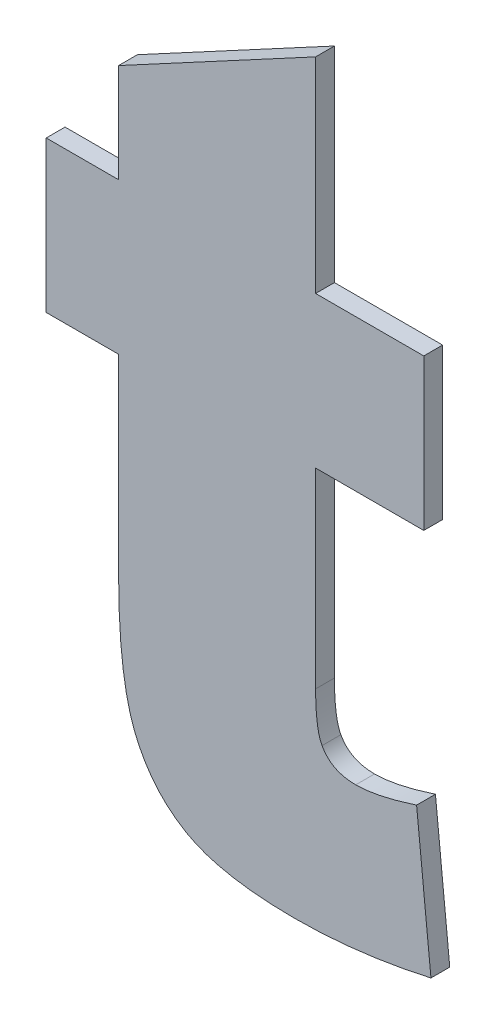
ISO-10303-21;
HEADER;
FILE_DESCRIPTION(('STEP AP214'),'2;1');
FILE_NAME('part.step','',(''),(''),'','','');
FILE_SCHEMA(('AUTOMOTIVE_DESIGN { 1 0 10303 214 1 1 1 1 }'));
ENDSEC;
DATA;
#1=APPLICATION_CONTEXT('core data for automotive mechanical design processes');
#2=APPLICATION_PROTOCOL_DEFINITION('international standard','automotive_design',2000,#1);
#3=PRODUCT_CONTEXT('',#1,'mechanical');
#4=PRODUCT('Part','Part','',(#3));
#5=PRODUCT_RELATED_PRODUCT_CATEGORY('part','',(#4));
#6=PRODUCT_DEFINITION_FORMATION('','',#4);
#7=PRODUCT_DEFINITION_CONTEXT('part definition',#1,'design');
#8=PRODUCT_DEFINITION('design','',#6,#7);
#9=PRODUCT_DEFINITION_SHAPE('','',#8);
#10=(LENGTH_UNIT() NAMED_UNIT(*) SI_UNIT(.MILLI.,.METRE.));
#11=(NAMED_UNIT(*) PLANE_ANGLE_UNIT() SI_UNIT($,.RADIAN.));
#12=(NAMED_UNIT(*) SI_UNIT($,.STERADIAN.) SOLID_ANGLE_UNIT());
#13=UNCERTAINTY_MEASURE_WITH_UNIT(LENGTH_MEASURE(1.E-05),#10,'distance_accuracy_value','');
#14=(GEOMETRIC_REPRESENTATION_CONTEXT(3) GLOBAL_UNCERTAINTY_ASSIGNED_CONTEXT((#13)) GLOBAL_UNIT_ASSIGNED_CONTEXT((#10,
#11,#12)) REPRESENTATION_CONTEXT('',''));
#15=CARTESIAN_POINT('',(0.,0.,0.));
#16=DIRECTION('',(0.,0.,1.));
#17=DIRECTION('',(1.,0.,0.));
#18=AXIS2_PLACEMENT_3D('',#15,#16,#17);
#19=CARTESIAN_POINT('',(1.2548751555268,-0.636643661734989,0.));
#20=DIRECTION('',(-1.,0.,0.));
#21=DIRECTION('',(0.,-1.,0.));
#22=AXIS2_PLACEMENT_3D('',#19,#20,#21);
#23=PLANE('',#22);
#24=DIRECTION('',(0.,-1.,0.));
#25=VECTOR('',#24,1.);
#26=CARTESIAN_POINT('',(1.2548751555268,-0.636643661734989,0.));
#27=LINE('',#26,#25);
#28=CARTESIAN_POINT('',(1.2548751555268,-0.636643661734989,0.));
#29=VERTEX_POINT('',#28);
#30=CARTESIAN_POINT('',(1.2548751555268,-0.660720812539698,0.));
#31=VERTEX_POINT('',#30);
#32=EDGE_CURVE('E11',#29,#31,#27,.T.);
#33=ORIENTED_EDGE('',*,*,#32,.T.);
#34=DIRECTION('',(0.,0.,1.));
#35=VECTOR('',#34,1.);
#36=CARTESIAN_POINT('',(1.2548751555268,-0.660720812539698,0.));
#37=LINE('',#36,#35);
#38=CARTESIAN_POINT('',(1.2548751555268,-0.660720812539698,0.003));
#39=VERTEX_POINT('',#38);
#40=EDGE_CURVE('E24',#31,#39,#37,.T.);
#41=ORIENTED_EDGE('',*,*,#40,.T.);
#42=DIRECTION('',(0.,-1.,0.));
#43=VECTOR('',#42,1.);
#44=CARTESIAN_POINT('',(1.2548751555268,-0.636643661734989,0.003));
#45=LINE('',#44,#43);
#46=CARTESIAN_POINT('',(1.2548751555268,-0.636643661734989,0.003));
#47=VERTEX_POINT('',#46);
#48=EDGE_CURVE('E154',#47,#39,#45,.T.);
#49=ORIENTED_EDGE('',*,*,#48,.F.);
#50=DIRECTION('',(0.,0.,1.));
#51=VECTOR('',#50,1.);
#52=CARTESIAN_POINT('',(1.2548751555268,-0.636643661734989,0.));
#53=LINE('',#52,#51);
#54=EDGE_CURVE('E331',#29,#47,#53,.T.);
#55=ORIENTED_EDGE('',*,*,#54,.F.);
#56=EDGE_LOOP('',(#33,#41,#49,#55));
#57=FACE_BOUND('',#56,.T.);
#58=ADVANCED_FACE('F17',(#57),#23,.T.);
#59=CARTESIAN_POINT('',(1.2664002371916,-0.636643661734989,0.));
#60=DIRECTION('',(0.,1.,0.));
#61=DIRECTION('',(-1.,0.,0.));
#62=AXIS2_PLACEMENT_3D('',#59,#60,#61);
#63=PLANE('',#62);
#64=DIRECTION('',(-1.,0.,0.));
#65=VECTOR('',#64,1.);
#66=CARTESIAN_POINT('',(1.2664002371916,-0.636643661734989,0.));
#67=LINE('',#66,#65);
#68=CARTESIAN_POINT('',(1.2664002371916,-0.636643661734989,0.));
#69=VERTEX_POINT('',#68);
#70=EDGE_CURVE('E328',#69,#29,#67,.T.);
#71=ORIENTED_EDGE('',*,*,#70,.T.);
#72=ORIENTED_EDGE('',*,*,#54,.T.);
#73=DIRECTION('',(-1.,0.,0.));
#74=VECTOR('',#73,1.);
#75=CARTESIAN_POINT('',(1.2664002371916,-0.636643661734989,0.003));
#76=LINE('',#75,#74);
#77=CARTESIAN_POINT('',(1.2664002371916,-0.636643661734989,0.003));
#78=VERTEX_POINT('',#77);
#79=EDGE_CURVE('E326',#78,#47,#76,.T.);
#80=ORIENTED_EDGE('',*,*,#79,.F.);
#81=DIRECTION('',(0.,0.,1.));
#82=VECTOR('',#81,1.);
#83=CARTESIAN_POINT('',(1.2664002371916,-0.636643661734989,0.));
#84=LINE('',#83,#82);
#85=EDGE_CURVE('E323',#69,#78,#84,.T.);
#86=ORIENTED_EDGE('',*,*,#85,.F.);
#87=EDGE_LOOP('',(#71,#72,#80,#86));
#88=FACE_BOUND('',#87,.T.);
#89=ADVANCED_FACE('F375',(#88),#63,.T.);
#90=CARTESIAN_POINT('',(1.2664002371916,-0.620896520450396,0.));
#91=DIRECTION('',(-1.,0.,0.));
#92=DIRECTION('',(0.,-1.,0.));
#93=AXIS2_PLACEMENT_3D('',#90,#91,#92);
#94=PLANE('',#93);
#95=DIRECTION('',(0.,-1.,0.));
#96=VECTOR('',#95,1.);
#97=CARTESIAN_POINT('',(1.2664002371916,-0.620896520450396,0.));
#98=LINE('',#97,#96);
#99=CARTESIAN_POINT('',(1.2664002371916,-0.620896520450396,0.));
#100=VERTEX_POINT('',#99);
#101=EDGE_CURVE('E320',#100,#69,#98,.T.);
#102=ORIENTED_EDGE('',*,*,#101,.T.);
#103=ORIENTED_EDGE('',*,*,#85,.T.);
#104=DIRECTION('',(0.,-1.,0.));
#105=VECTOR('',#104,1.);
#106=CARTESIAN_POINT('',(1.2664002371916,-0.620896520450396,0.003));
#107=LINE('',#106,#105);
#108=CARTESIAN_POINT('',(1.2664002371916,-0.620896520450396,0.003));
#109=VERTEX_POINT('',#108);
#110=EDGE_CURVE('E317',#109,#78,#107,.T.);
#111=ORIENTED_EDGE('',*,*,#110,.F.);
#112=DIRECTION('',(0.,0.,1.));
#113=VECTOR('',#112,1.);
#114=CARTESIAN_POINT('',(1.2664002371916,-0.620896520450396,0.));
#115=LINE('',#114,#113);
#116=EDGE_CURVE('E314',#100,#109,#115,.T.);
#117=ORIENTED_EDGE('',*,*,#116,.F.);
#118=EDGE_LOOP('',(#102,#103,#111,#117));
#119=FACE_BOUND('',#118,.T.);
#120=ADVANCED_FACE('F372',(#119),#94,.T.);
#121=CARTESIAN_POINT('',(1.2977804100414,-0.604008281971269,0.));
#122=DIRECTION('',(-0.473908861749229,0.880573898520476,0.));
#123=DIRECTION('',(-0.880573898520476,-0.473908861749229,0.));
#124=AXIS2_PLACEMENT_3D('',#121,#122,#123);
#125=PLANE('',#124);
#126=DIRECTION('',(-0.880573898520476,-0.473908861749229,0.));
#127=VECTOR('',#126,1.);
#128=CARTESIAN_POINT('',(1.2977804100414,-0.604008281971269,0.));
#129=LINE('',#128,#127);
#130=CARTESIAN_POINT('',(1.2977804100414,-0.604008281971269,0.));
#131=VERTEX_POINT('',#130);
#132=EDGE_CURVE('E311',#131,#100,#129,.T.);
#133=ORIENTED_EDGE('',*,*,#132,.T.);
#134=ORIENTED_EDGE('',*,*,#116,.T.);
#135=DIRECTION('',(-0.880573898520476,-0.473908861749229,0.));
#136=VECTOR('',#135,1.);
#137=CARTESIAN_POINT('',(1.2977804100414,-0.604008281971269,0.003));
#138=LINE('',#137,#136);
#139=CARTESIAN_POINT('',(1.2977804100414,-0.604008281971269,0.003));
#140=VERTEX_POINT('',#139);
#141=EDGE_CURVE('E308',#140,#109,#138,.T.);
#142=ORIENTED_EDGE('',*,*,#141,.F.);
#143=DIRECTION('',(0.,0.,1.));
#144=VECTOR('',#143,1.);
#145=CARTESIAN_POINT('',(1.2977804100414,-0.604008281971269,0.));
#146=LINE('',#145,#144);
#147=EDGE_CURVE('E305',#131,#140,#146,.T.);
#148=ORIENTED_EDGE('',*,*,#147,.F.);
#149=EDGE_LOOP('',(#133,#134,#142,#148));
#150=FACE_BOUND('',#149,.T.);
#151=ADVANCED_FACE('F369',(#150),#125,.T.);
#152=CARTESIAN_POINT('',(1.2977804100414,-0.636643661734989,0.));
#153=DIRECTION('',(1.,0.,0.));
#154=DIRECTION('',(0.,1.,0.));
#155=AXIS2_PLACEMENT_3D('',#152,#153,#154);
#156=PLANE('',#155);
#157=DIRECTION('',(0.,1.,0.));
#158=VECTOR('',#157,1.);
#159=CARTESIAN_POINT('',(1.2977804100414,-0.636643661734989,0.));
#160=LINE('',#159,#158);
#161=CARTESIAN_POINT('',(1.2977804100414,-0.636643661734989,0.));
#162=VERTEX_POINT('',#161);
#163=EDGE_CURVE('E302',#162,#131,#160,.T.);
#164=ORIENTED_EDGE('',*,*,#163,.T.);
#165=ORIENTED_EDGE('',*,*,#147,.T.);
#166=DIRECTION('',(0.,1.,0.));
#167=VECTOR('',#166,1.);
#168=CARTESIAN_POINT('',(1.2977804100414,-0.636643661734989,0.003));
#169=LINE('',#168,#167);
#170=CARTESIAN_POINT('',(1.2977804100414,-0.636643661734989,0.003));
#171=VERTEX_POINT('',#170);
#172=EDGE_CURVE('E299',#171,#140,#169,.T.);
#173=ORIENTED_EDGE('',*,*,#172,.F.);
#174=DIRECTION('',(0.,0.,1.));
#175=VECTOR('',#174,1.);
#176=CARTESIAN_POINT('',(1.2977804100414,-0.636643661734989,0.));
#177=LINE('',#176,#175);
#178=EDGE_CURVE('E296',#162,#171,#177,.T.);
#179=ORIENTED_EDGE('',*,*,#178,.F.);
#180=EDGE_LOOP('',(#164,#165,#173,#179));
#181=FACE_BOUND('',#180,.T.);
#182=ADVANCED_FACE('F366',(#181),#156,.T.);
#183=CARTESIAN_POINT('',(1.3150109776789,-0.636643661734989,0.));
#184=DIRECTION('',(0.,1.,0.));
#185=DIRECTION('',(-1.,0.,0.));
#186=AXIS2_PLACEMENT_3D('',#183,#184,#185);
#187=PLANE('',#186);
#188=DIRECTION('',(-1.,0.,0.));
#189=VECTOR('',#188,1.);
#190=CARTESIAN_POINT('',(1.3150109776789,-0.636643661734989,0.));
#191=LINE('',#190,#189);
#192=CARTESIAN_POINT('',(1.3150109776789,-0.636643661734989,0.));
#193=VERTEX_POINT('',#192);
#194=EDGE_CURVE('E293',#193,#162,#191,.T.);
#195=ORIENTED_EDGE('',*,*,#194,.T.);
#196=ORIENTED_EDGE('',*,*,#178,.T.);
#197=DIRECTION('',(-1.,0.,0.));
#198=VECTOR('',#197,1.);
#199=CARTESIAN_POINT('',(1.3150109776789,-0.636643661734989,0.003));
#200=LINE('',#199,#198);
#201=CARTESIAN_POINT('',(1.3150109776789,-0.636643661734989,0.003));
#202=VERTEX_POINT('',#201);
#203=EDGE_CURVE('E290',#202,#171,#200,.T.);
#204=ORIENTED_EDGE('',*,*,#203,.F.);
#205=DIRECTION('',(0.,0.,1.));
#206=VECTOR('',#205,1.);
#207=CARTESIAN_POINT('',(1.3150109776789,-0.636643661734989,0.));
#208=LINE('',#207,#206);
#209=EDGE_CURVE('E287',#193,#202,#208,.T.);
#210=ORIENTED_EDGE('',*,*,#209,.F.);
#211=EDGE_LOOP('',(#195,#196,#204,#210));
#212=FACE_BOUND('',#211,.T.);
#213=ADVANCED_FACE('F363',(#212),#187,.T.);
#214=CARTESIAN_POINT('',(1.3150109776789,-0.660720812539698,0.));
#215=DIRECTION('',(1.,0.,0.));
#216=DIRECTION('',(0.,1.,0.));
#217=AXIS2_PLACEMENT_3D('',#214,#215,#216);
#218=PLANE('',#217);
#219=DIRECTION('',(0.,1.,0.));
#220=VECTOR('',#219,1.);
#221=CARTESIAN_POINT('',(1.3150109776789,-0.660720812539698,0.));
#222=LINE('',#221,#220);
#223=CARTESIAN_POINT('',(1.3150109776789,-0.660720812539698,0.));
#224=VERTEX_POINT('',#223);
#225=EDGE_CURVE('E284',#224,#193,#222,.T.);
#226=ORIENTED_EDGE('',*,*,#225,.T.);
#227=ORIENTED_EDGE('',*,*,#209,.T.);
#228=DIRECTION('',(0.,1.,0.));
#229=VECTOR('',#228,1.);
#230=CARTESIAN_POINT('',(1.3150109776789,-0.660720812539698,0.003));
#231=LINE('',#230,#229);
#232=CARTESIAN_POINT('',(1.3150109776789,-0.660720812539698,0.003));
#233=VERTEX_POINT('',#232);
#234=EDGE_CURVE('E281',#233,#202,#231,.T.);
#235=ORIENTED_EDGE('',*,*,#234,.F.);
#236=DIRECTION('',(0.,0.,1.));
#237=VECTOR('',#236,1.);
#238=CARTESIAN_POINT('',(1.3150109776789,-0.660720812539698,0.));
#239=LINE('',#238,#237);
#240=EDGE_CURVE('E278',#224,#233,#239,.T.);
#241=ORIENTED_EDGE('',*,*,#240,.F.);
#242=EDGE_LOOP('',(#226,#227,#235,#241));
#243=FACE_BOUND('',#242,.T.);
#244=ADVANCED_FACE('F360',(#243),#218,.T.);
#245=CARTESIAN_POINT('',(1.2977804100414,-0.660720812539698,0.));
#246=DIRECTION('',(0.,-1.,0.));
#247=DIRECTION('',(1.,0.,0.));
#248=AXIS2_PLACEMENT_3D('',#245,#246,#247);
#249=PLANE('',#248);
#250=DIRECTION('',(1.,0.,0.));
#251=VECTOR('',#250,1.);
#252=CARTESIAN_POINT('',(1.2977804100414,-0.660720812539698,0.));
#253=LINE('',#252,#251);
#254=CARTESIAN_POINT('',(1.2977804100414,-0.660720812539698,0.));
#255=VERTEX_POINT('',#254);
#256=EDGE_CURVE('E275',#255,#224,#253,.T.);
#257=ORIENTED_EDGE('',*,*,#256,.T.);
#258=ORIENTED_EDGE('',*,*,#240,.T.);
#259=DIRECTION('',(1.,0.,0.));
#260=VECTOR('',#259,1.);
#261=CARTESIAN_POINT('',(1.2977804100414,-0.660720812539698,0.003));
#262=LINE('',#261,#260);
#263=CARTESIAN_POINT('',(1.2977804100414,-0.660720812539698,0.003));
#264=VERTEX_POINT('',#263);
#265=EDGE_CURVE('E272',#264,#233,#262,.T.);
#266=ORIENTED_EDGE('',*,*,#265,.F.);
#267=DIRECTION('',(0.,0.,1.));
#268=VECTOR('',#267,1.);
#269=CARTESIAN_POINT('',(1.2977804100414,-0.660720812539698,0.));
#270=LINE('',#269,#268);
#271=EDGE_CURVE('E269',#255,#264,#270,.T.);
#272=ORIENTED_EDGE('',*,*,#271,.F.);
#273=EDGE_LOOP('',(#257,#258,#266,#272));
#274=FACE_BOUND('',#273,.T.);
#275=ADVANCED_FACE('F357',(#274),#249,.T.);
#276=CARTESIAN_POINT('',(1.2977804100414,-0.691188107633801,0.));
#277=DIRECTION('',(1.,0.,0.));
#278=DIRECTION('',(0.,1.,0.));
#279=AXIS2_PLACEMENT_3D('',#276,#277,#278);
#280=PLANE('',#279);
#281=DIRECTION('',(0.,1.,0.));
#282=VECTOR('',#281,1.);
#283=CARTESIAN_POINT('',(1.2977804100414,-0.691188107633801,0.));
#284=LINE('',#283,#282);
#285=CARTESIAN_POINT('',(1.2977804100414,-0.691188107633801,0.));
#286=VERTEX_POINT('',#285);
#287=EDGE_CURVE('E266',#286,#255,#284,.T.);
#288=ORIENTED_EDGE('',*,*,#287,.T.);
#289=ORIENTED_EDGE('',*,*,#271,.T.);
#290=DIRECTION('',(0.,1.,0.));
#291=VECTOR('',#290,1.);
#292=CARTESIAN_POINT('',(1.2977804100414,-0.691188107633801,0.003));
#293=LINE('',#292,#291);
#294=CARTESIAN_POINT('',(1.2977804100414,-0.691188107633801,0.003));
#295=VERTEX_POINT('',#294);
#296=EDGE_CURVE('E263',#295,#264,#293,.T.);
#297=ORIENTED_EDGE('',*,*,#296,.F.);
#298=DIRECTION('',(0.,0.,1.));
#299=VECTOR('',#298,1.);
#300=CARTESIAN_POINT('',(1.2977804100414,-0.691188107633801,0.));
#301=LINE('',#300,#299);
#302=EDGE_CURVE('E257',#286,#295,#301,.T.);
#303=ORIENTED_EDGE('',*,*,#302,.F.);
#304=EDGE_LOOP('',(#288,#289,#297,#303));
#305=FACE_BOUND('',#304,.T.);
#306=ADVANCED_FACE('F354',(#305),#280,.T.);
#307=CARTESIAN_POINT('',(1.2988073975165,-0.698491129678832,0.));
#308=CARTESIAN_POINT('',(1.2988073975165,-0.698491129678832,0.003));
#309=CARTESIAN_POINT('',(1.2977804099869,-0.696665374198189,0.));
#310=CARTESIAN_POINT('',(1.2977804099869,-0.696665374198189,0.003));
#311=CARTESIAN_POINT('',(1.2977804100414,-0.691188107633801,0.));
#312=CARTESIAN_POINT('',(1.2977804100414,-0.691188107633801,0.003));
#313=B_SPLINE_SURFACE_WITH_KNOTS('',2,1,((#307,#308),(#309,#310),(#311,#312)),.UNSPECIFIED.,.F.,
.F.,.F.,(3,3),(2,2),(-1.,0.),(0.,0.0003),.UNSPECIFIED.);
#314=CARTESIAN_POINT('',(1.2988073975165,-0.698491129678832,0.));
#315=CARTESIAN_POINT('',(1.2977804099869,-0.696665374198189,0.));
#316=CARTESIAN_POINT('',(1.2977804100414,-0.691188107633801,0.));
#317=B_SPLINE_CURVE_WITH_KNOTS('',2,(#314,#315,#316),.UNSPECIFIED.,.F.,.F.,(3,3),(-1.,0.),.UNSPECIFIED.);
#318=CARTESIAN_POINT('',(1.2988073975165,-0.698491129678832,0.));
#319=VERTEX_POINT('',#318);
#320=EDGE_CURVE('E249',#319,#286,#317,.T.);
#321=CARTESIAN_POINT('',(1.2988073975165,-0.698491129678832,0.003));
#322=CARTESIAN_POINT('',(1.2977804099869,-0.696665374198189,0.003));
#323=CARTESIAN_POINT('',(1.2977804100414,-0.691188107633801,0.003));
#324=B_SPLINE_CURVE_WITH_KNOTS('',2,(#321,#322,#323),.UNSPECIFIED.,.F.,.F.,(3,3),(-1.,0.),.UNSPECIFIED.);
#325=CARTESIAN_POINT('',(1.2988073975165,-0.698491129678832,0.003));
#326=VERTEX_POINT('',#325);
#327=EDGE_CURVE('E244',#326,#295,#324,.T.);
#328=DIRECTION('',(0.,0.,1.));
#329=VECTOR('',#328,1.);
#330=CARTESIAN_POINT('',(1.2988073975165,-0.698491129678832,0.));
#331=LINE('',#330,#329);
#332=EDGE_CURVE('E238',#319,#326,#331,.T.);
#333=ORIENTED_EDGE('',*,*,#320,.T.);
#334=ORIENTED_EDGE('',*,*,#302,.T.);
#335=ORIENTED_EDGE('',*,*,#327,.F.);
#336=ORIENTED_EDGE('',*,*,#332,.F.);
#337=EDGE_LOOP('',(#333,#334,#335,#336));
#338=FACE_BOUND('',#337,.T.);
#339=ADVANCED_FACE('F351',(#338),#313,.T.);
#340=CARTESIAN_POINT('',(1.3041705543308,-0.701229762945719,0.));
#341=CARTESIAN_POINT('',(1.3041705543308,-0.701229762945719,0.003));
#342=CARTESIAN_POINT('',(1.3002908238694,-0.701229785142743,0.));
#343=CARTESIAN_POINT('',(1.3002908238694,-0.701229785142743,0.003));
#344=CARTESIAN_POINT('',(1.2988073975165,-0.698491129678832,0.));
#345=CARTESIAN_POINT('',(1.2988073975165,-0.698491129678832,0.003));
#346=B_SPLINE_SURFACE_WITH_KNOTS('',2,1,((#340,#341),(#342,#343),(#344,#345)),.UNSPECIFIED.,.F.,
.F.,.F.,(3,3),(2,2),(-1.,0.),(0.,0.0003),.UNSPECIFIED.);
#347=CARTESIAN_POINT('',(1.3041705543308,-0.701229762945719,0.));
#348=CARTESIAN_POINT('',(1.3002908238694,-0.701229785142743,0.));
#349=CARTESIAN_POINT('',(1.2988073975165,-0.698491129678832,0.));
#350=B_SPLINE_CURVE_WITH_KNOTS('',2,(#347,#348,#349),.UNSPECIFIED.,.F.,.F.,(3,3),(-1.,0.),.UNSPECIFIED.);
#351=CARTESIAN_POINT('',(1.3041705543308,-0.701229762945719,0.));
#352=VERTEX_POINT('',#351);
#353=EDGE_CURVE('E230',#352,#319,#350,.T.);
#354=CARTESIAN_POINT('',(1.3041705543308,-0.701229762945719,0.003));
#355=CARTESIAN_POINT('',(1.3002908238694,-0.701229785142743,0.003));
#356=CARTESIAN_POINT('',(1.2988073975165,-0.698491129678832,0.003));
#357=B_SPLINE_CURVE_WITH_KNOTS('',2,(#354,#355,#356),.UNSPECIFIED.,.F.,.F.,(3,3),(-1.,0.),.UNSPECIFIED.);
#358=CARTESIAN_POINT('',(1.3041705543308,-0.701229762945719,0.003));
#359=VERTEX_POINT('',#358);
#360=EDGE_CURVE('E225',#359,#326,#357,.T.);
#361=DIRECTION('',(0.,0.,1.));
#362=VECTOR('',#361,1.);
#363=CARTESIAN_POINT('',(1.3041705543308,-0.701229762945719,0.));
#364=LINE('',#363,#362);
#365=EDGE_CURVE('E219',#352,#359,#364,.T.);
#366=ORIENTED_EDGE('',*,*,#353,.T.);
#367=ORIENTED_EDGE('',*,*,#332,.T.);
#368=ORIENTED_EDGE('',*,*,#360,.F.);
#369=ORIENTED_EDGE('',*,*,#365,.F.);
#370=EDGE_LOOP('',(#366,#367,#368,#369));
#371=FACE_BOUND('',#370,.T.);
#372=ADVANCED_FACE('F348',(#371),#346,.T.);
#373=CARTESIAN_POINT('',(1.3138698804843,-0.69917578799555,0.));
#374=CARTESIAN_POINT('',(1.3138698804843,-0.69917578799555,0.003));
#375=CARTESIAN_POINT('',(1.3075938484368,-0.701229770653084,0.));
#376=CARTESIAN_POINT('',(1.3075938484368,-0.701229770653084,0.003));
#377=CARTESIAN_POINT('',(1.3041705543308,-0.701229762945719,0.));
#378=CARTESIAN_POINT('',(1.3041705543308,-0.701229762945719,0.003));
#379=B_SPLINE_SURFACE_WITH_KNOTS('',2,1,((#373,#374),(#375,#376),(#377,#378)),.UNSPECIFIED.,.F.,
.F.,.F.,(3,3),(2,2),(-1.,0.),(0.,0.0003),.UNSPECIFIED.);
#380=CARTESIAN_POINT('',(1.3138698804843,-0.69917578799555,0.));
#381=CARTESIAN_POINT('',(1.3075938484368,-0.701229770653084,0.));
#382=CARTESIAN_POINT('',(1.3041705543308,-0.701229762945719,0.));
#383=B_SPLINE_CURVE_WITH_KNOTS('',2,(#380,#381,#382),.UNSPECIFIED.,.F.,.F.,(3,3),(-1.,0.),.UNSPECIFIED.);
#384=CARTESIAN_POINT('',(1.3138698804843,-0.69917578799555,0.));
#385=VERTEX_POINT('',#384);
#386=EDGE_CURVE('E211',#385,#352,#383,.T.);
#387=CARTESIAN_POINT('',(1.3138698804843,-0.69917578799555,0.003));
#388=CARTESIAN_POINT('',(1.3075938484368,-0.701229770653084,0.003));
#389=CARTESIAN_POINT('',(1.3041705543308,-0.701229762945719,0.003));
#390=B_SPLINE_CURVE_WITH_KNOTS('',2,(#387,#388,#389),.UNSPECIFIED.,.F.,.F.,(3,3),(-1.,0.),.UNSPECIFIED.);
#391=CARTESIAN_POINT('',(1.3138698804843,-0.69917578799555,0.003));
#392=VERTEX_POINT('',#391);
#393=EDGE_CURVE('E206',#392,#359,#390,.T.);
#394=DIRECTION('',(0.,0.,1.));
#395=VECTOR('',#394,1.);
#396=CARTESIAN_POINT('',(1.3138698804843,-0.69917578799555,0.));
#397=LINE('',#396,#395);
#398=EDGE_CURVE('E203',#385,#392,#397,.T.);
#399=ORIENTED_EDGE('',*,*,#386,.T.);
#400=ORIENTED_EDGE('',*,*,#365,.T.);
#401=ORIENTED_EDGE('',*,*,#393,.F.);
#402=ORIENTED_EDGE('',*,*,#398,.F.);
#403=EDGE_LOOP('',(#399,#400,#401,#402));
#404=FACE_BOUND('',#403,.T.);
#405=ADVANCED_FACE('F345',(#404),#379,.T.);
#406=CARTESIAN_POINT('',(1.3161520748734,-0.721883622166816,0.));
#407=DIRECTION('',(0.994987562733226,0.0999987500231608,0.));
#408=DIRECTION('',(-0.0999987500231608,0.994987562733226,0.));
#409=AXIS2_PLACEMENT_3D('',#406,#407,#408);
#410=PLANE('',#409);
#411=DIRECTION('',(-0.0999987500231608,0.994987562733226,0.));
#412=VECTOR('',#411,1.);
#413=CARTESIAN_POINT('',(1.3161520748734,-0.721883622166816,0.));
#414=LINE('',#413,#412);
#415=CARTESIAN_POINT('',(1.3161520748734,-0.721883622166816,0.));
#416=VERTEX_POINT('',#415);
#417=EDGE_CURVE('E200',#416,#385,#414,.T.);
#418=ORIENTED_EDGE('',*,*,#417,.T.);
#419=ORIENTED_EDGE('',*,*,#398,.T.);
#420=DIRECTION('',(-0.0999987500231608,0.994987562733226,0.));
#421=VECTOR('',#420,1.);
#422=CARTESIAN_POINT('',(1.3161520748734,-0.721883622166816,0.003));
#423=LINE('',#422,#421);
#424=CARTESIAN_POINT('',(1.3161520748734,-0.721883622166816,0.003));
#425=VERTEX_POINT('',#424);
#426=EDGE_CURVE('E197',#425,#392,#423,.T.);
#427=ORIENTED_EDGE('',*,*,#426,.F.);
#428=DIRECTION('',(0.,0.,1.));
#429=VECTOR('',#428,1.);
#430=CARTESIAN_POINT('',(1.3161520748734,-0.721883622166816,0.));
#431=LINE('',#430,#429);
#432=EDGE_CURVE('E191',#416,#425,#431,.T.);
#433=ORIENTED_EDGE('',*,*,#432,.F.);
#434=EDGE_LOOP('',(#418,#419,#427,#433));
#435=FACE_BOUND('',#434,.T.);
#436=ADVANCED_FACE('F342',(#435),#410,.T.);
#437=CARTESIAN_POINT('',(1.2944712281772,-0.724508145714247,0.));
#438=CARTESIAN_POINT('',(1.2944712281772,-0.724508145714247,0.003));
#439=CARTESIAN_POINT('',(1.3045128834891,-0.724508107047124,0.));
#440=CARTESIAN_POINT('',(1.3045128834891,-0.724508107047124,0.003));
#441=CARTESIAN_POINT('',(1.3161520748734,-0.721883622166816,0.));
#442=CARTESIAN_POINT('',(1.3161520748734,-0.721883622166816,0.003));
#443=B_SPLINE_SURFACE_WITH_KNOTS('',2,1,((#437,#438),(#439,#440),(#441,#442)),.UNSPECIFIED.,.F.,
.F.,.F.,(3,3),(2,2),(-1.,0.),(0.,0.0003),.UNSPECIFIED.);
#444=CARTESIAN_POINT('',(1.2944712281772,-0.724508145714247,0.));
#445=CARTESIAN_POINT('',(1.3045128834891,-0.724508107047124,0.));
#446=CARTESIAN_POINT('',(1.3161520748734,-0.721883622166816,0.));
#447=B_SPLINE_CURVE_WITH_KNOTS('',2,(#444,#445,#446),.UNSPECIFIED.,.F.,.F.,(3,3),(-1.,0.),.UNSPECIFIED.);
#448=CARTESIAN_POINT('',(1.2944712281772,-0.724508145714247,0.));
#449=VERTEX_POINT('',#448);
#450=EDGE_CURVE('E183',#449,#416,#447,.T.);
#451=CARTESIAN_POINT('',(1.2944712281772,-0.724508145714247,0.003));
#452=CARTESIAN_POINT('',(1.3045128834891,-0.724508107047124,0.003));
#453=CARTESIAN_POINT('',(1.3161520748734,-0.721883622166816,0.003));
#454=B_SPLINE_CURVE_WITH_KNOTS('',2,(#451,#452,#453),.UNSPECIFIED.,.F.,.F.,(3,3),(-1.,0.),.UNSPECIFIED.);
#455=CARTESIAN_POINT('',(1.2944712281772,-0.724508145714247,0.003));
#456=VERTEX_POINT('',#455);
#457=EDGE_CURVE('E178',#456,#425,#454,.T.);
#458=DIRECTION('',(0.,0.,1.));
#459=VECTOR('',#458,1.);
#460=CARTESIAN_POINT('',(1.2944712281772,-0.724508145714247,0.));
#461=LINE('',#460,#459);
#462=EDGE_CURVE('E172',#449,#456,#461,.T.);
#463=ORIENTED_EDGE('',*,*,#450,.T.);
#464=ORIENTED_EDGE('',*,*,#432,.T.);
#465=ORIENTED_EDGE('',*,*,#457,.F.);
#466=ORIENTED_EDGE('',*,*,#462,.F.);
#467=EDGE_LOOP('',(#463,#464,#465,#466));
#468=FACE_BOUND('',#467,.T.);
#469=ADVANCED_FACE('F339',(#468),#443,.T.);
#470=CARTESIAN_POINT('',(1.2664002371916,-0.690959888194891,0.));
#471=CARTESIAN_POINT('',(1.2664002371916,-0.690959888194891,0.003));
#472=CARTESIAN_POINT('',(1.2664002712153,-0.705337712845982,0.));
#473=CARTESIAN_POINT('',(1.2664002712153,-0.705337712845982,0.003));
#474=CARTESIAN_POINT('',(1.2717634585428,-0.718232098452892,0.));
#475=CARTESIAN_POINT('',(1.2717634585428,-0.718232098452892,0.003));
#476=CARTESIAN_POINT('',(1.2828321161814,-0.724508106830007,0.));
#477=CARTESIAN_POINT('',(1.2828321161814,-0.724508106830007,0.003));
#478=CARTESIAN_POINT('',(1.2944712281772,-0.724508145714247,0.));
#479=CARTESIAN_POINT('',(1.2944712281772,-0.724508145714247,0.003));
#480=B_SPLINE_SURFACE_WITH_KNOTS('',2,1,((#470,#471),(#472,#473),(#474,#475),(#476,#477),(#478,
#479)),.UNSPECIFIED.,.F.,.F.,.F.,(3,1,1,3),(2,2),(-3.,-2.,-1.,0.),(0.,0.0003),.UNSPECIFIED.);
#481=CARTESIAN_POINT('',(1.2664002371916,-0.690959888194891,0.));
#482=CARTESIAN_POINT('',(1.2664002712153,-0.705337712845982,0.));
#483=CARTESIAN_POINT('',(1.2717634585428,-0.718232098452892,0.));
#484=CARTESIAN_POINT('',(1.2828321161814,-0.724508106830007,0.));
#485=CARTESIAN_POINT('',(1.2944712281772,-0.724508145714247,0.));
#486=B_SPLINE_CURVE_WITH_KNOTS('',2,(#481,#482,#483,#484,#485),.UNSPECIFIED.,.F.,.F.,(3,1,1,3),
(-3.,-2.,-1.,0.),.UNSPECIFIED.);
#487=CARTESIAN_POINT('',(1.2664002371916,-0.690959888194891,0.));
#488=VERTEX_POINT('',#487);
#489=EDGE_CURVE('E164',#488,#449,#486,.T.);
#490=CARTESIAN_POINT('',(1.2664002371916,-0.690959888194891,0.003));
#491=CARTESIAN_POINT('',(1.2664002712153,-0.705337712845982,0.003));
#492=CARTESIAN_POINT('',(1.2717634585428,-0.718232098452892,0.003));
#493=CARTESIAN_POINT('',(1.2828321161814,-0.724508106830007,0.003));
#494=CARTESIAN_POINT('',(1.2944712281772,-0.724508145714247,0.003));
#495=B_SPLINE_CURVE_WITH_KNOTS('',2,(#490,#491,#492,#493,#494),.UNSPECIFIED.,.F.,.F.,(3,1,1,3),
(-3.,-2.,-1.,0.),.UNSPECIFIED.);
#496=CARTESIAN_POINT('',(1.2664002371916,-0.690959888194891,0.003));
#497=VERTEX_POINT('',#496);
#498=EDGE_CURVE('E160',#497,#456,#495,.T.);
#499=DIRECTION('',(0.,0.,1.));
#500=VECTOR('',#499,1.);
#501=CARTESIAN_POINT('',(1.2664002371916,-0.690959888194891,0.));
#502=LINE('',#501,#500);
#503=EDGE_CURVE('E139',#488,#497,#502,.T.);
#504=ORIENTED_EDGE('',*,*,#489,.T.);
#505=ORIENTED_EDGE('',*,*,#462,.T.);
#506=ORIENTED_EDGE('',*,*,#498,.F.);
#507=ORIENTED_EDGE('',*,*,#503,.F.);
#508=EDGE_LOOP('',(#504,#505,#506,#507));
#509=FACE_BOUND('',#508,.T.);
#510=ADVANCED_FACE('F337',(#509),#480,.T.);
#511=CARTESIAN_POINT('',(1.2664002371916,-0.660720812539698,0.));
#512=DIRECTION('',(-1.,0.,0.));
#513=DIRECTION('',(0.,-1.,0.));
#514=AXIS2_PLACEMENT_3D('',#511,#512,#513);
#515=PLANE('',#514);
#516=DIRECTION('',(0.,-1.,0.));
#517=VECTOR('',#516,1.);
#518=CARTESIAN_POINT('',(1.2664002371916,-0.660720812539698,0.));
#519=LINE('',#518,#517);
#520=CARTESIAN_POINT('',(1.2664002371916,-0.660720812539698,0.));
#521=VERTEX_POINT('',#520);
#522=EDGE_CURVE('E143',#521,#488,#519,.T.);
#523=ORIENTED_EDGE('',*,*,#522,.T.);
#524=ORIENTED_EDGE('',*,*,#503,.T.);
#525=DIRECTION('',(0.,-1.,0.));
#526=VECTOR('',#525,1.);
#527=CARTESIAN_POINT('',(1.2664002371916,-0.660720812539698,0.003));
#528=LINE('',#527,#526);
#529=CARTESIAN_POINT('',(1.2664002371916,-0.660720812539698,0.003));
#530=VERTEX_POINT('',#529);
#531=EDGE_CURVE('E132',#530,#497,#528,.T.);
#532=ORIENTED_EDGE('',*,*,#531,.F.);
#533=DIRECTION('',(0.,0.,1.));
#534=VECTOR('',#533,1.);
#535=CARTESIAN_POINT('',(1.2664002371916,-0.660720812539698,0.));
#536=LINE('',#535,#534);
#537=EDGE_CURVE('E136',#521,#530,#536,.T.);
#538=ORIENTED_EDGE('',*,*,#537,.F.);
#539=EDGE_LOOP('',(#523,#524,#532,#538));
#540=FACE_BOUND('',#539,.T.);
#541=ADVANCED_FACE('F135',(#540),#515,.T.);
#542=CARTESIAN_POINT('',(1.2548751555268,-0.660720812539698,0.));
#543=DIRECTION('',(0.,-1.,0.));
#544=DIRECTION('',(1.,0.,0.));
#545=AXIS2_PLACEMENT_3D('',#542,#543,#544);
#546=PLANE('',#545);
#547=DIRECTION('',(1.,0.,0.));
#548=VECTOR('',#547,1.);
#549=CARTESIAN_POINT('',(1.2548751555268,-0.660720812539698,0.));
#550=LINE('',#549,#548);
#551=EDGE_CURVE('E149',#31,#521,#550,.T.);
#552=ORIENTED_EDGE('',*,*,#551,.T.);
#553=ORIENTED_EDGE('',*,*,#537,.T.);
#554=DIRECTION('',(1.,0.,0.));
#555=VECTOR('',#554,1.);
#556=CARTESIAN_POINT('',(1.2548751555268,-0.660720812539698,0.003));
#557=LINE('',#556,#555);
#558=EDGE_CURVE('E148',#39,#530,#557,.T.);
#559=ORIENTED_EDGE('',*,*,#558,.F.);
#560=ORIENTED_EDGE('',*,*,#40,.F.);
#561=EDGE_LOOP('',(#552,#553,#559,#560));
#562=FACE_BOUND('',#561,.T.);
#563=ADVANCED_FACE('F147',(#562),#546,.T.);
#564=CARTESIAN_POINT('',(1.2855136152001,-0.664258213842758,0.003));
#565=DIRECTION('',(0.,0.,1.));
#566=DIRECTION('',(1.,0.,0.));
#567=AXIS2_PLACEMENT_3D('',#564,#565,#566);
#568=PLANE('',#567);
#569=ORIENTED_EDGE('',*,*,#558,.T.);
#570=ORIENTED_EDGE('',*,*,#531,.T.);
#571=ORIENTED_EDGE('',*,*,#498,.T.);
#572=ORIENTED_EDGE('',*,*,#457,.T.);
#573=ORIENTED_EDGE('',*,*,#426,.T.);
#574=ORIENTED_EDGE('',*,*,#393,.T.);
#575=ORIENTED_EDGE('',*,*,#360,.T.);
#576=ORIENTED_EDGE('',*,*,#327,.T.);
#577=ORIENTED_EDGE('',*,*,#296,.T.);
#578=ORIENTED_EDGE('',*,*,#265,.T.);
#579=ORIENTED_EDGE('',*,*,#234,.T.);
#580=ORIENTED_EDGE('',*,*,#203,.T.);
#581=ORIENTED_EDGE('',*,*,#172,.T.);
#582=ORIENTED_EDGE('',*,*,#141,.T.);
#583=ORIENTED_EDGE('',*,*,#110,.T.);
#584=ORIENTED_EDGE('',*,*,#79,.T.);
#585=ORIENTED_EDGE('',*,*,#48,.T.);
#586=EDGE_LOOP('',(#569,#570,#571,#572,#573,#574,#575,#576,#577,#578,#579,#580,#581,#582,#583,
#584,#585));
#587=FACE_BOUND('',#586,.T.);
#588=ADVANCED_FACE('F152',(#587),#568,.T.);
#589=CARTESIAN_POINT('',(1.2855136152001,-0.664258213842758,0.));
#590=DIRECTION('',(0.,0.,1.));
#591=DIRECTION('',(1.,0.,0.));
#592=AXIS2_PLACEMENT_3D('',#589,#590,#591);
#593=PLANE('',#592);
#594=ORIENTED_EDGE('',*,*,#551,.F.);
#595=ORIENTED_EDGE('',*,*,#32,.F.);
#596=ORIENTED_EDGE('',*,*,#70,.F.);
#597=ORIENTED_EDGE('',*,*,#101,.F.);
#598=ORIENTED_EDGE('',*,*,#132,.F.);
#599=ORIENTED_EDGE('',*,*,#163,.F.);
#600=ORIENTED_EDGE('',*,*,#194,.F.);
#601=ORIENTED_EDGE('',*,*,#225,.F.);
#602=ORIENTED_EDGE('',*,*,#256,.F.);
#603=ORIENTED_EDGE('',*,*,#287,.F.);
#604=ORIENTED_EDGE('',*,*,#320,.F.);
#605=ORIENTED_EDGE('',*,*,#353,.F.);
#606=ORIENTED_EDGE('',*,*,#386,.F.);
#607=ORIENTED_EDGE('',*,*,#417,.F.);
#608=ORIENTED_EDGE('',*,*,#450,.F.);
#609=ORIENTED_EDGE('',*,*,#489,.F.);
#610=ORIENTED_EDGE('',*,*,#522,.F.);
#611=EDGE_LOOP('',(#594,#595,#596,#597,#598,#599,#600,#601,#602,#603,#604,#605,#606,#607,#608,
#609,#610));
#612=FACE_BOUND('',#611,.T.);
#613=ADVANCED_FACE('F334',(#612),#593,.F.);
#614=CLOSED_SHELL('',(#58,#89,#120,#151,#182,#213,#244,#275,#306,#339,#372,#405,#436,#469,#510,
#541,#563,#588,#613));
#615=MANIFOLD_SOLID_BREP('B1',#614);
#616=ADVANCED_BREP_SHAPE_REPRESENTATION('',(#18,#615),#14);
#617=SHAPE_DEFINITION_REPRESENTATION(#9,#616);
ENDSEC;
END-ISO-10303-21;
